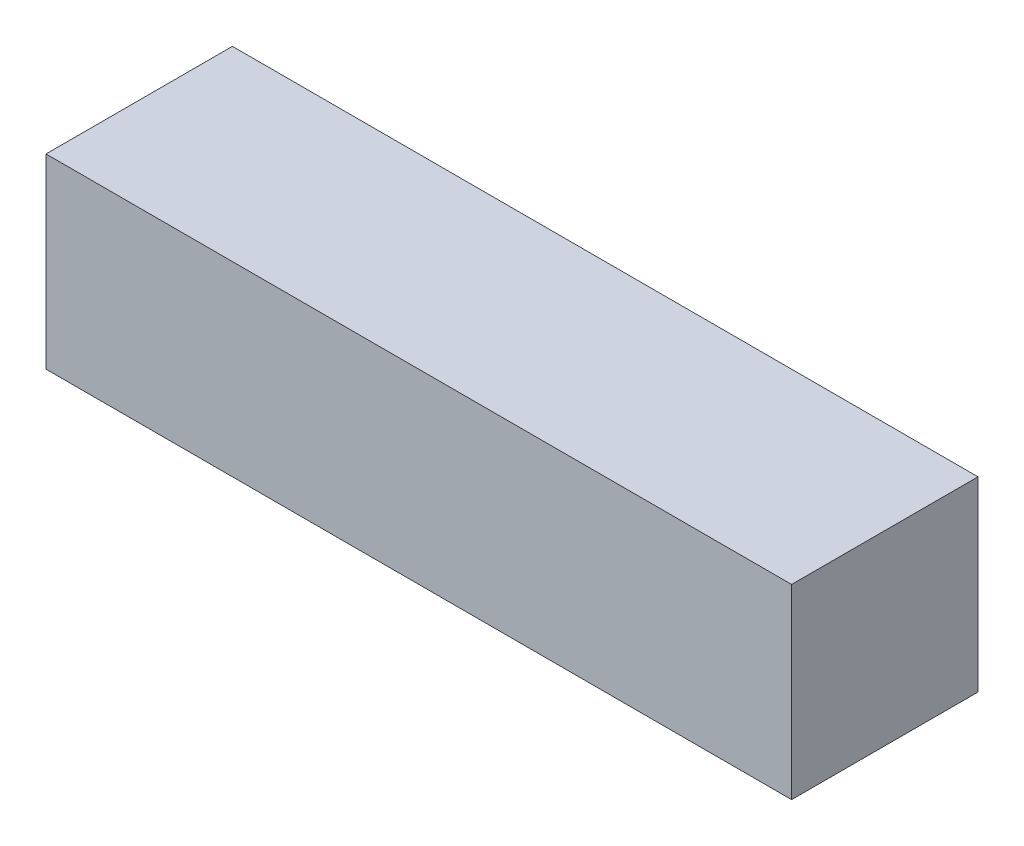
ISO-10303-21;
HEADER;
FILE_DESCRIPTION(('STEP AP214'),'2;1');
FILE_NAME('part.step','',(''),(''),'','','');
FILE_SCHEMA(('AUTOMOTIVE_DESIGN { 1 0 10303 214 1 1 1 1 }'));
ENDSEC;
DATA;
#1=APPLICATION_CONTEXT('core data for automotive mechanical design processes');
#2=APPLICATION_PROTOCOL_DEFINITION('international standard','automotive_design',2000,#1);
#3=PRODUCT_CONTEXT('',#1,'mechanical');
#4=PRODUCT('Part','Part','',(#3));
#5=PRODUCT_RELATED_PRODUCT_CATEGORY('part','',(#4));
#6=PRODUCT_DEFINITION_FORMATION('','',#4);
#7=PRODUCT_DEFINITION_CONTEXT('part definition',#1,'design');
#8=PRODUCT_DEFINITION('design','',#6,#7);
#9=PRODUCT_DEFINITION_SHAPE('','',#8);
#10=(LENGTH_UNIT() NAMED_UNIT(*) SI_UNIT(.MILLI.,.METRE.));
#11=(NAMED_UNIT(*) PLANE_ANGLE_UNIT() SI_UNIT($,.RADIAN.));
#12=(NAMED_UNIT(*) SI_UNIT($,.STERADIAN.) SOLID_ANGLE_UNIT());
#13=UNCERTAINTY_MEASURE_WITH_UNIT(LENGTH_MEASURE(1.E-05),#10,'distance_accuracy_value','');
#14=(GEOMETRIC_REPRESENTATION_CONTEXT(3) GLOBAL_UNCERTAINTY_ASSIGNED_CONTEXT((#13)) GLOBAL_UNIT_ASSIGNED_CONTEXT((#10,
#11,#12)) REPRESENTATION_CONTEXT('',''));
#15=CARTESIAN_POINT('',(0.,0.,0.));
#16=DIRECTION('',(0.,0.,1.));
#17=DIRECTION('',(1.,0.,0.));
#18=AXIS2_PLACEMENT_3D('',#15,#16,#17);
#19=CARTESIAN_POINT('',(0.,19.05,0.));
#20=DIRECTION('',(1.,0.,0.));
#21=DIRECTION('',(0.,0.,-1.));
#22=AXIS2_PLACEMENT_3D('',#19,#20,#21);
#23=PLANE('',#22);
#24=DIRECTION('',(0.,0.,1.));
#25=VECTOR('',#24,1.);
#26=CARTESIAN_POINT('',(0.,0.,0.));
#27=LINE('',#26,#25);
#28=CARTESIAN_POINT('',(0.,0.,-19.05));
#29=VERTEX_POINT('',#28);
#30=CARTESIAN_POINT('',(0.,0.,0.));
#31=VERTEX_POINT('',#30);
#32=EDGE_CURVE('E104',#29,#31,#27,.T.);
#33=ORIENTED_EDGE('',*,*,#32,.T.);
#34=DIRECTION('',(0.,-1.,0.));
#35=VECTOR('',#34,1.);
#36=CARTESIAN_POINT('',(0.,19.05,0.));
#37=LINE('',#36,#35);
#38=CARTESIAN_POINT('',(0.,19.05,0.));
#39=VERTEX_POINT('',#38);
#40=EDGE_CURVE('E11',#39,#31,#37,.T.);
#41=ORIENTED_EDGE('',*,*,#40,.F.);
#42=DIRECTION('',(0.,0.,1.));
#43=VECTOR('',#42,1.);
#44=CARTESIAN_POINT('',(0.,19.05,0.));
#45=LINE('',#44,#43);
#46=CARTESIAN_POINT('',(0.,19.05,-19.05));
#47=VERTEX_POINT('',#46);
#48=EDGE_CURVE('E92',#47,#39,#45,.T.);
#49=ORIENTED_EDGE('',*,*,#48,.F.);
#50=DIRECTION('',(0.,-1.,0.));
#51=VECTOR('',#50,1.);
#52=CARTESIAN_POINT('',(0.,19.05,-19.05));
#53=LINE('',#52,#51);
#54=EDGE_CURVE('E100',#47,#29,#53,.T.);
#55=ORIENTED_EDGE('',*,*,#54,.T.);
#56=EDGE_LOOP('',(#33,#41,#49,#55));
#57=FACE_BOUND('',#56,.T.);
#58=ADVANCED_FACE('F41',(#57),#23,.F.);
#59=CARTESIAN_POINT('',(0.,19.05,0.));
#60=DIRECTION('',(0.,0.,-1.));
#61=DIRECTION('',(-1.,0.,0.));
#62=AXIS2_PLACEMENT_3D('',#59,#60,#61);
#63=PLANE('',#62);
#64=DIRECTION('',(1.,0.,0.));
#65=VECTOR('',#64,1.);
#66=CARTESIAN_POINT('',(0.,0.,0.));
#67=LINE('',#66,#65);
#68=CARTESIAN_POINT('',(76.2,0.,0.));
#69=VERTEX_POINT('',#68);
#70=EDGE_CURVE('E96',#31,#69,#67,.T.);
#71=ORIENTED_EDGE('',*,*,#70,.T.);
#72=DIRECTION('',(0.,-1.,0.));
#73=VECTOR('',#72,1.);
#74=CARTESIAN_POINT('',(76.2,19.05,0.));
#75=LINE('',#74,#73);
#76=CARTESIAN_POINT('',(76.2,19.05,0.));
#77=VERTEX_POINT('',#76);
#78=EDGE_CURVE('E49',#77,#69,#75,.T.);
#79=ORIENTED_EDGE('',*,*,#78,.F.);
#80=DIRECTION('',(1.,0.,0.));
#81=VECTOR('',#80,1.);
#82=CARTESIAN_POINT('',(0.,19.05,0.));
#83=LINE('',#82,#81);
#84=EDGE_CURVE('E87',#39,#77,#83,.T.);
#85=ORIENTED_EDGE('',*,*,#84,.F.);
#86=ORIENTED_EDGE('',*,*,#40,.T.);
#87=EDGE_LOOP('',(#71,#79,#85,#86));
#88=FACE_BOUND('',#87,.T.);
#89=ADVANCED_FACE('F95',(#88),#63,.F.);
#90=CARTESIAN_POINT('',(76.2,19.05,0.));
#91=DIRECTION('',(-1.,0.,0.));
#92=DIRECTION('',(0.,0.,1.));
#93=AXIS2_PLACEMENT_3D('',#90,#91,#92);
#94=PLANE('',#93);
#95=DIRECTION('',(0.,0.,-1.));
#96=VECTOR('',#95,1.);
#97=CARTESIAN_POINT('',(76.2,0.,0.));
#98=LINE('',#97,#96);
#99=CARTESIAN_POINT('',(76.2,0.,-19.05));
#100=VERTEX_POINT('',#99);
#101=EDGE_CURVE('E74',#69,#100,#98,.T.);
#102=ORIENTED_EDGE('',*,*,#101,.T.);
#103=DIRECTION('',(0.,-1.,0.));
#104=VECTOR('',#103,1.);
#105=CARTESIAN_POINT('',(76.2,19.05,-19.05));
#106=LINE('',#105,#104);
#107=CARTESIAN_POINT('',(76.2,19.05,-19.05));
#108=VERTEX_POINT('',#107);
#109=EDGE_CURVE('E97',#108,#100,#106,.T.);
#110=ORIENTED_EDGE('',*,*,#109,.F.);
#111=DIRECTION('',(0.,0.,-1.));
#112=VECTOR('',#111,1.);
#113=CARTESIAN_POINT('',(76.2,19.05,0.));
#114=LINE('',#113,#112);
#115=EDGE_CURVE('E90',#77,#108,#114,.T.);
#116=ORIENTED_EDGE('',*,*,#115,.F.);
#117=ORIENTED_EDGE('',*,*,#78,.T.);
#118=EDGE_LOOP('',(#102,#110,#116,#117));
#119=FACE_BOUND('',#118,.T.);
#120=ADVANCED_FACE('F98',(#119),#94,.F.);
#121=CARTESIAN_POINT('',(0.,19.05,-19.05));
#122=DIRECTION('',(0.,0.,1.));
#123=DIRECTION('',(1.,0.,0.));
#124=AXIS2_PLACEMENT_3D('',#121,#122,#123);
#125=PLANE('',#124);
#126=DIRECTION('',(-1.,0.,0.));
#127=VECTOR('',#126,1.);
#128=CARTESIAN_POINT('',(0.,0.,-19.05));
#129=LINE('',#128,#127);
#130=EDGE_CURVE('E80',#100,#29,#129,.T.);
#131=ORIENTED_EDGE('',*,*,#130,.T.);
#132=ORIENTED_EDGE('',*,*,#54,.F.);
#133=DIRECTION('',(-1.,0.,0.));
#134=VECTOR('',#133,1.);
#135=CARTESIAN_POINT('',(0.,19.05,-19.05));
#136=LINE('',#135,#134);
#137=EDGE_CURVE('E57',#108,#47,#136,.T.);
#138=ORIENTED_EDGE('',*,*,#137,.F.);
#139=ORIENTED_EDGE('',*,*,#109,.T.);
#140=EDGE_LOOP('',(#131,#132,#138,#139));
#141=FACE_BOUND('',#140,.T.);
#142=ADVANCED_FACE('F111',(#141),#125,.F.);
#143=CARTESIAN_POINT('',(0.,19.05,0.));
#144=DIRECTION('',(0.,-1.,0.));
#145=DIRECTION('',(0.,0.,-1.));
#146=AXIS2_PLACEMENT_3D('',#143,#144,#145);
#147=PLANE('',#146);
#148=ORIENTED_EDGE('',*,*,#48,.T.);
#149=ORIENTED_EDGE('',*,*,#84,.T.);
#150=ORIENTED_EDGE('',*,*,#115,.T.);
#151=ORIENTED_EDGE('',*,*,#137,.T.);
#152=EDGE_LOOP('',(#148,#149,#150,#151));
#153=FACE_BOUND('',#152,.T.);
#154=ADVANCED_FACE('F88',(#153),#147,.F.);
#155=CARTESIAN_POINT('',(0.,0.,0.));
#156=DIRECTION('',(0.,-1.,0.));
#157=DIRECTION('',(0.,0.,-1.));
#158=AXIS2_PLACEMENT_3D('',#155,#156,#157);
#159=PLANE('',#158);
#160=ORIENTED_EDGE('',*,*,#32,.F.);
#161=ORIENTED_EDGE('',*,*,#130,.F.);
#162=ORIENTED_EDGE('',*,*,#101,.F.);
#163=ORIENTED_EDGE('',*,*,#70,.F.);
#164=EDGE_LOOP('',(#160,#161,#162,#163));
#165=FACE_BOUND('',#164,.T.);
#166=ADVANCED_FACE('F114',(#165),#159,.T.);
#167=CLOSED_SHELL('',(#58,#89,#120,#142,#154,#166));
#168=MANIFOLD_SOLID_BREP('B2',#167);
#169=ADVANCED_BREP_SHAPE_REPRESENTATION('',(#18,#168),#14);
#170=SHAPE_DEFINITION_REPRESENTATION(#9,#169);
ENDSEC;
END-ISO-10303-21;
